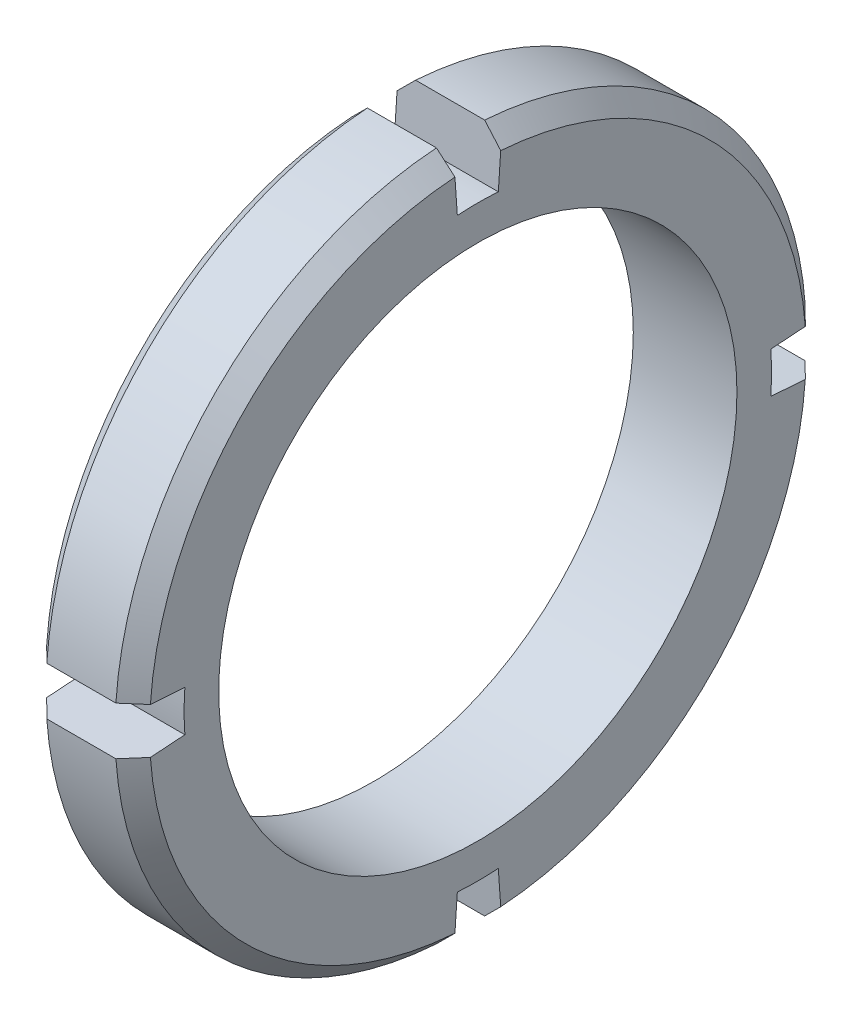
ISO-10303-21;
HEADER;
FILE_DESCRIPTION(('STEP AP214'),'2;1');
FILE_NAME('part.step','',(''),(''),'','','');
FILE_SCHEMA(('AUTOMOTIVE_DESIGN { 1 0 10303 214 1 1 1 1 }'));
ENDSEC;
DATA;
#1=APPLICATION_CONTEXT('core data for automotive mechanical design processes');
#2=APPLICATION_PROTOCOL_DEFINITION('international standard','automotive_design',2000,#1);
#3=PRODUCT_CONTEXT('',#1,'mechanical');
#4=PRODUCT('Part','Part','',(#3));
#5=PRODUCT_RELATED_PRODUCT_CATEGORY('part','',(#4));
#6=PRODUCT_DEFINITION_FORMATION('','',#4);
#7=PRODUCT_DEFINITION_CONTEXT('part definition',#1,'design');
#8=PRODUCT_DEFINITION('design','',#6,#7);
#9=PRODUCT_DEFINITION_SHAPE('','',#8);
#10=(LENGTH_UNIT() NAMED_UNIT(*) SI_UNIT(.MILLI.,.METRE.));
#11=(NAMED_UNIT(*) PLANE_ANGLE_UNIT() SI_UNIT($,.RADIAN.));
#12=(NAMED_UNIT(*) SI_UNIT($,.STERADIAN.) SOLID_ANGLE_UNIT());
#13=UNCERTAINTY_MEASURE_WITH_UNIT(LENGTH_MEASURE(1.E-05),#10,'distance_accuracy_value','');
#14=(GEOMETRIC_REPRESENTATION_CONTEXT(3) GLOBAL_UNCERTAINTY_ASSIGNED_CONTEXT((#13)) GLOBAL_UNIT_ASSIGNED_CONTEXT((#10,
#11,#12)) REPRESENTATION_CONTEXT('',''));
#15=CARTESIAN_POINT('',(0.,0.,0.));
#16=DIRECTION('',(0.,0.,1.));
#17=DIRECTION('',(1.,0.,0.));
#18=AXIS2_PLACEMENT_3D('',#15,#16,#17);
#19=CARTESIAN_POINT('',(6.,0.,0.));
#20=DIRECTION('',(-1.,0.,0.));
#21=DIRECTION('',(0.,0.,1.));
#22=AXIS2_PLACEMENT_3D('',#19,#20,#21);
#23=CYLINDRICAL_SURFACE('',#22,20.);
#24=CARTESIAN_POINT('',(4.99999999999999,0.,0.));
#25=DIRECTION('',(1.,0.,0.));
#26=DIRECTION('',(0.,0.,-1.));
#27=AXIS2_PLACEMENT_3D('',#24,#25,#26);
#28=CIRCLE('',#27,20.);
#29=CARTESIAN_POINT('',(4.99999999999999,-1.39512947488251,-19.9512810051965));
#30=VERTEX_POINT('',#29);
#31=CARTESIAN_POINT('',(4.99999999999999,-19.9512810051965,-1.39512947488272));
#32=VERTEX_POINT('',#31);
#33=EDGE_CURVE('E324',#30,#32,#28,.F.);
#34=ORIENTED_EDGE('',*,*,#33,.T.);
#35=DIRECTION('',(-1.,0.,0.));
#36=VECTOR('',#35,1.);
#37=CARTESIAN_POINT('',(6.,-19.9512810051965,-1.39512947488272));
#38=LINE('',#37,#36);
#39=CARTESIAN_POINT('',(1.,-19.9512810051965,-1.39512947488272));
#40=VERTEX_POINT('',#39);
#41=EDGE_CURVE('E230',#32,#40,#38,.T.);
#42=ORIENTED_EDGE('',*,*,#41,.T.);
#43=CARTESIAN_POINT('',(1.,0.,0.));
#44=DIRECTION('',(1.,0.,0.));
#45=DIRECTION('',(0.,0.,-1.));
#46=AXIS2_PLACEMENT_3D('',#43,#44,#45);
#47=CIRCLE('',#46,20.);
#48=CARTESIAN_POINT('',(1.,-1.39512947488251,-19.9512810051965));
#49=VERTEX_POINT('',#48);
#50=EDGE_CURVE('E327',#40,#49,#47,.T.);
#51=ORIENTED_EDGE('',*,*,#50,.T.);
#52=DIRECTION('',(-1.,0.,0.));
#53=VECTOR('',#52,1.);
#54=CARTESIAN_POINT('',(6.,-1.39512947488251,-19.9512810051965));
#55=LINE('',#54,#53);
#56=EDGE_CURVE('E300',#49,#30,#55,.F.);
#57=ORIENTED_EDGE('',*,*,#56,.T.);
#58=EDGE_LOOP('',(#34,#42,#51,#57));
#59=FACE_BOUND('',#58,.T.);
#60=ADVANCED_FACE('F33',(#59),#23,.T.);
#61=CARTESIAN_POINT('',(1.,0.,0.));
#62=DIRECTION('',(1.,0.,0.));
#63=DIRECTION('',(0.,0.,-1.));
#64=AXIS2_PLACEMENT_3D('',#61,#62,#63);
#65=CONICAL_SURFACE('',#64,20.,0.78539816339745);
#66=DIRECTION('',(-0.707106781186546,0.70538430460664,0.04932527561614));
#67=VECTOR('',#66,1.);
#68=CARTESIAN_POINT('',(-18.9999999999999,0.,0.));
#69=LINE('',#68,#67);
#70=CARTESIAN_POINT('',(0.,-18.9537169549366,-1.32537300113858));
#71=VERTEX_POINT('',#70);
#72=EDGE_CURVE('E228',#71,#40,#69,.F.);
#73=ORIENTED_EDGE('',*,*,#72,.F.);
#74=CARTESIAN_POINT('',(0.,0.,0.));
#75=DIRECTION('',(1.,0.,0.));
#76=DIRECTION('',(0.,0.,-1.));
#77=AXIS2_PLACEMENT_3D('',#74,#75,#76);
#78=CIRCLE('',#77,19.);
#79=CARTESIAN_POINT('',(0.,-1.32537300113838,-18.9537169549367));
#80=VERTEX_POINT('',#79);
#81=EDGE_CURVE('E334',#80,#71,#78,.F.);
#82=ORIENTED_EDGE('',*,*,#81,.F.);
#83=DIRECTION('',(0.707106781186546,-0.0493252756161326,-0.705384304606641));
#84=VECTOR('',#83,1.);
#85=CARTESIAN_POINT('',(-18.9999999999999,0.,0.));
#86=LINE('',#85,#84);
#87=EDGE_CURVE('E304',#49,#80,#86,.F.);
#88=ORIENTED_EDGE('',*,*,#87,.F.);
#89=ORIENTED_EDGE('',*,*,#50,.F.);
#90=EDGE_LOOP('',(#73,#82,#88,#89));
#91=FACE_BOUND('',#90,.T.);
#92=ADVANCED_FACE('F411',(#91),#65,.T.);
#93=CARTESIAN_POINT('',(6.,0.,0.));
#94=DIRECTION('',(-1.,0.,0.));
#95=DIRECTION('',(0.,0.,1.));
#96=AXIS2_PLACEMENT_3D('',#93,#94,#95);
#97=CONICAL_SURFACE('',#96,19.,0.785398163397443);
#98=DIRECTION('',(-0.707106781186551,-0.705384304606635,-0.0493252756161397));
#99=VECTOR('',#98,1.);
#100=CARTESIAN_POINT('',(25.0000000000002,0.,0.));
#101=LINE('',#100,#99);
#102=CARTESIAN_POINT('',(6.,-18.9537169549366,-1.32537300113859));
#103=VERTEX_POINT('',#102);
#104=EDGE_CURVE('E233',#32,#103,#101,.F.);
#105=ORIENTED_EDGE('',*,*,#104,.F.);
#106=ORIENTED_EDGE('',*,*,#33,.F.);
#107=DIRECTION('',(0.707106781186551,0.0493252756161322,0.705384304606636));
#108=VECTOR('',#107,1.);
#109=CARTESIAN_POINT('',(25.0000000000002,0.,0.));
#110=LINE('',#109,#108);
#111=CARTESIAN_POINT('',(6.,-1.32537300113838,-18.9537169549367));
#112=VERTEX_POINT('',#111);
#113=EDGE_CURVE('E342',#112,#30,#110,.F.);
#114=ORIENTED_EDGE('',*,*,#113,.F.);
#115=CARTESIAN_POINT('',(6.,0.,0.));
#116=DIRECTION('',(1.,0.,0.));
#117=DIRECTION('',(0.,0.,-1.));
#118=AXIS2_PLACEMENT_3D('',#115,#116,#117);
#119=CIRCLE('',#118,19.);
#120=EDGE_CURVE('E337',#103,#112,#119,.T.);
#121=ORIENTED_EDGE('',*,*,#120,.F.);
#122=EDGE_LOOP('',(#105,#106,#114,#121));
#123=FACE_BOUND('',#122,.T.);
#124=ADVANCED_FACE('F377',(#123),#97,.T.);
#125=CARTESIAN_POINT('',(1.,-1.39512947488251,19.9512810051965));
#126=VERTEX_POINT('',#125);
#127=CARTESIAN_POINT('',(1.,-19.9512810051965,1.3951294748823));
#128=VERTEX_POINT('',#127);
#129=EDGE_CURVE('E399',#126,#128,#47,.T.);
#130=ORIENTED_EDGE('',*,*,#129,.T.);
#131=DIRECTION('',(-1.,0.,0.));
#132=VECTOR('',#131,1.);
#133=CARTESIAN_POINT('',(6.,-19.9512810051965,1.3951294748823));
#134=LINE('',#133,#132);
#135=CARTESIAN_POINT('',(4.99999999999999,-19.9512810051965,1.3951294748823));
#136=VERTEX_POINT('',#135);
#137=EDGE_CURVE('E223',#128,#136,#134,.F.);
#138=ORIENTED_EDGE('',*,*,#137,.T.);
#139=CARTESIAN_POINT('',(4.99999999999999,-1.39512947488251,19.9512810051965));
#140=VERTEX_POINT('',#139);
#141=EDGE_CURVE('E328',#136,#140,#28,.F.);
#142=ORIENTED_EDGE('',*,*,#141,.T.);
#143=DIRECTION('',(-1.,0.,0.));
#144=VECTOR('',#143,1.);
#145=CARTESIAN_POINT('',(6.,-1.39512947488251,19.9512810051965));
#146=LINE('',#145,#144);
#147=EDGE_CURVE('E255',#140,#126,#146,.T.);
#148=ORIENTED_EDGE('',*,*,#147,.T.);
#149=EDGE_LOOP('',(#130,#138,#142,#148));
#150=FACE_BOUND('',#149,.T.);
#151=ADVANCED_FACE('F457',(#150),#23,.T.);
#152=DIRECTION('',(0.707106781186546,-0.705384304606642,0.0493252756161252));
#153=VECTOR('',#152,1.);
#154=CARTESIAN_POINT('',(-18.9999999999999,0.,0.));
#155=LINE('',#154,#153);
#156=CARTESIAN_POINT('',(0.,-18.9537169549367,1.32537300113819));
#157=VERTEX_POINT('',#156);
#158=EDGE_CURVE('E48',#128,#157,#155,.F.);
#159=ORIENTED_EDGE('',*,*,#158,.F.);
#160=ORIENTED_EDGE('',*,*,#129,.F.);
#161=DIRECTION('',(-0.707106781186546,0.0493252756161326,-0.705384304606641));
#162=VECTOR('',#161,1.);
#163=CARTESIAN_POINT('',(-18.9999999999999,0.,0.));
#164=LINE('',#163,#162);
#165=CARTESIAN_POINT('',(0.,-1.32537300113839,18.9537169549367));
#166=VERTEX_POINT('',#165);
#167=EDGE_CURVE('E253',#166,#126,#164,.F.);
#168=ORIENTED_EDGE('',*,*,#167,.F.);
#169=EDGE_CURVE('E338',#157,#166,#78,.F.);
#170=ORIENTED_EDGE('',*,*,#169,.F.);
#171=EDGE_LOOP('',(#159,#160,#168,#170));
#172=FACE_BOUND('',#171,.T.);
#173=ADVANCED_FACE('F454',(#172),#65,.T.);
#174=DIRECTION('',(0.707106781186551,0.705384304606637,-0.0493252756161248));
#175=VECTOR('',#174,1.);
#176=CARTESIAN_POINT('',(25.0000000000002,0.,0.));
#177=LINE('',#176,#175);
#178=CARTESIAN_POINT('',(6.,-18.9537169549367,1.32537300113819));
#179=VERTEX_POINT('',#178);
#180=EDGE_CURVE('E226',#179,#136,#177,.F.);
#181=ORIENTED_EDGE('',*,*,#180,.F.);
#182=CARTESIAN_POINT('',(6.,-1.32537300113839,18.9537169549367));
#183=VERTEX_POINT('',#182);
#184=EDGE_CURVE('E217',#183,#179,#119,.T.);
#185=ORIENTED_EDGE('',*,*,#184,.F.);
#186=DIRECTION('',(-0.707106781186551,-0.0493252756161323,0.705384304606636));
#187=VECTOR('',#186,1.);
#188=CARTESIAN_POINT('',(25.0000000000002,0.,0.));
#189=LINE('',#188,#187);
#190=EDGE_CURVE('E258',#140,#183,#189,.F.);
#191=ORIENTED_EDGE('',*,*,#190,.F.);
#192=ORIENTED_EDGE('',*,*,#141,.F.);
#193=EDGE_LOOP('',(#181,#185,#191,#192));
#194=FACE_BOUND('',#193,.T.);
#195=ADVANCED_FACE('F456',(#194),#97,.T.);
#196=CARTESIAN_POINT('',(1.,19.9512810051965,1.39512947488258));
#197=VERTEX_POINT('',#196);
#198=CARTESIAN_POINT('',(1.,1.39512947488251,19.9512810051965));
#199=VERTEX_POINT('',#198);
#200=EDGE_CURVE('E333',#197,#199,#47,.T.);
#201=ORIENTED_EDGE('',*,*,#200,.T.);
#202=DIRECTION('',(-1.,0.,0.));
#203=VECTOR('',#202,1.);
#204=CARTESIAN_POINT('',(6.,1.39512947488251,19.9512810051965));
#205=LINE('',#204,#203);
#206=CARTESIAN_POINT('',(4.99999999999999,1.39512947488251,19.9512810051965));
#207=VERTEX_POINT('',#206);
#208=EDGE_CURVE('E248',#199,#207,#205,.F.);
#209=ORIENTED_EDGE('',*,*,#208,.T.);
#210=CARTESIAN_POINT('',(4.99999999999999,19.9512810051965,1.39512947488258));
#211=VERTEX_POINT('',#210);
#212=EDGE_CURVE('E390',#207,#211,#28,.F.);
#213=ORIENTED_EDGE('',*,*,#212,.T.);
#214=DIRECTION('',(-1.,0.,0.));
#215=VECTOR('',#214,1.);
#216=CARTESIAN_POINT('',(6.,19.9512810051965,1.39512947488258));
#217=LINE('',#216,#215);
#218=EDGE_CURVE('E280',#211,#197,#217,.T.);
#219=ORIENTED_EDGE('',*,*,#218,.T.);
#220=EDGE_LOOP('',(#201,#209,#213,#219));
#221=FACE_BOUND('',#220,.T.);
#222=ADVANCED_FACE('F394',(#221),#23,.T.);
#223=DIRECTION('',(0.707106781186546,0.0493252756161326,0.705384304606641));
#224=VECTOR('',#223,1.);
#225=CARTESIAN_POINT('',(-18.9999999999999,0.,0.));
#226=LINE('',#225,#224);
#227=CARTESIAN_POINT('',(0.,1.32537300113838,18.9537169549367));
#228=VERTEX_POINT('',#227);
#229=EDGE_CURVE('E56',#199,#228,#226,.F.);
#230=ORIENTED_EDGE('',*,*,#229,.F.);
#231=ORIENTED_EDGE('',*,*,#200,.F.);
#232=DIRECTION('',(-0.707106781186546,-0.705384304606641,-0.0493252756161351));
#233=VECTOR('',#232,1.);
#234=CARTESIAN_POINT('',(-18.9999999999999,0.,0.));
#235=LINE('',#234,#233);
#236=CARTESIAN_POINT('',(0.,18.9537169549366,1.32537300113845));
#237=VERTEX_POINT('',#236);
#238=EDGE_CURVE('E283',#237,#197,#235,.F.);
#239=ORIENTED_EDGE('',*,*,#238,.F.);
#240=EDGE_CURVE('E446',#228,#237,#78,.F.);
#241=ORIENTED_EDGE('',*,*,#240,.F.);
#242=EDGE_LOOP('',(#230,#231,#239,#241));
#243=FACE_BOUND('',#242,.T.);
#244=ADVANCED_FACE('F445',(#243),#65,.T.);
#245=DIRECTION('',(0.707106781186551,-0.0493252756161322,-0.705384304606636));
#246=VECTOR('',#245,1.);
#247=CARTESIAN_POINT('',(25.0000000000002,0.,0.));
#248=LINE('',#247,#246);
#249=CARTESIAN_POINT('',(6.,1.32537300113838,18.9537169549367));
#250=VERTEX_POINT('',#249);
#251=EDGE_CURVE('E251',#250,#207,#248,.F.);
#252=ORIENTED_EDGE('',*,*,#251,.F.);
#253=CARTESIAN_POINT('',(6.,18.9537169549367,1.32537300113845));
#254=VERTEX_POINT('',#253);
#255=EDGE_CURVE('E343',#254,#250,#119,.T.);
#256=ORIENTED_EDGE('',*,*,#255,.F.);
#257=DIRECTION('',(-0.707106781186551,0.705384304606636,0.0493252756161348));
#258=VECTOR('',#257,1.);
#259=CARTESIAN_POINT('',(25.0000000000002,0.,0.));
#260=LINE('',#259,#258);
#261=EDGE_CURVE('E352',#211,#254,#260,.F.);
#262=ORIENTED_EDGE('',*,*,#261,.F.);
#263=ORIENTED_EDGE('',*,*,#212,.F.);
#264=EDGE_LOOP('',(#252,#256,#262,#263));
#265=FACE_BOUND('',#264,.T.);
#266=ADVANCED_FACE('F388',(#265),#97,.T.);
#267=CARTESIAN_POINT('',(6.,0.,0.));
#268=DIRECTION('',(-1.,0.,0.));
#269=DIRECTION('',(0.,0.,1.));
#270=AXIS2_PLACEMENT_3D('',#267,#268,#269);
#271=CYLINDRICAL_SURFACE('',#270,15.);
#272=CARTESIAN_POINT('',(6.,0.,0.));
#273=DIRECTION('',(1.,0.,0.));
#274=DIRECTION('',(0.,0.,-1.));
#275=AXIS2_PLACEMENT_3D('',#272,#273,#274);
#276=CIRCLE('',#275,15.);
#277=CARTESIAN_POINT('',(6.,0.,-15.));
#278=VERTEX_POINT('',#277);
#279=EDGE_CURVE('E318',#278,#278,#276,.T.);
#280=ORIENTED_EDGE('',*,*,#279,.T.);
#281=EDGE_LOOP('',(#280));
#282=FACE_BOUND('',#281,.T.);
#283=CARTESIAN_POINT('',(0.,0.,0.));
#284=DIRECTION('',(1.,0.,0.));
#285=DIRECTION('',(0.,0.,-1.));
#286=AXIS2_PLACEMENT_3D('',#283,#284,#285);
#287=CIRCLE('',#286,15.);
#288=CARTESIAN_POINT('',(0.,0.,-15.));
#289=VERTEX_POINT('',#288);
#290=EDGE_CURVE('E317',#289,#289,#287,.T.);
#291=ORIENTED_EDGE('',*,*,#290,.F.);
#292=EDGE_LOOP('',(#291));
#293=FACE_BOUND('',#292,.T.);
#294=ADVANCED_FACE('F472',(#282,#293),#271,.F.);
#295=CARTESIAN_POINT('',(1.,1.39512947488251,-19.9512810051965));
#296=VERTEX_POINT('',#295);
#297=CARTESIAN_POINT('',(1.,19.9512810051965,-1.39512947488244));
#298=VERTEX_POINT('',#297);
#299=EDGE_CURVE('E329',#296,#298,#47,.T.);
#300=ORIENTED_EDGE('',*,*,#299,.T.);
#301=DIRECTION('',(-1.,0.,0.));
#302=VECTOR('',#301,1.);
#303=CARTESIAN_POINT('',(6.,19.9512810051965,-1.39512947488244));
#304=LINE('',#303,#302);
#305=CARTESIAN_POINT('',(4.99999999999999,19.9512810051965,-1.39512947488244));
#306=VERTEX_POINT('',#305);
#307=EDGE_CURVE('E271',#298,#306,#304,.F.);
#308=ORIENTED_EDGE('',*,*,#307,.T.);
#309=CARTESIAN_POINT('',(4.99999999999999,1.39512947488251,-19.9512810051965));
#310=VERTEX_POINT('',#309);
#311=EDGE_CURVE('E321',#306,#310,#28,.F.);
#312=ORIENTED_EDGE('',*,*,#311,.T.);
#313=DIRECTION('',(-1.,0.,0.));
#314=VECTOR('',#313,1.);
#315=CARTESIAN_POINT('',(6.,1.39512947488251,-19.9512810051965));
#316=LINE('',#315,#314);
#317=EDGE_CURVE('E309',#310,#296,#316,.T.);
#318=ORIENTED_EDGE('',*,*,#317,.T.);
#319=EDGE_LOOP('',(#300,#308,#312,#318));
#320=FACE_BOUND('',#319,.T.);
#321=ADVANCED_FACE('F429',(#320),#23,.T.);
#322=CARTESIAN_POINT('',(6.,0.,-44.1414213562373));
#323=DIRECTION('',(1.,0.,0.));
#324=DIRECTION('',(0.,0.,-1.));
#325=AXIS2_PLACEMENT_3D('',#322,#323,#324);
#326=PLANE('',#325);
#327=DIRECTION('',(0.,0.997564050259823,0.069756473744136));
#328=VECTOR('',#327,1.);
#329=CARTESIAN_POINT('',(6.,-16.958588854417,-1.18586005365031));
#330=LINE('',#329,#328);
#331=CARTESIAN_POINT('',(6.,-16.958588854417,-1.18586005365031));
#332=VERTEX_POINT('',#331);
#333=EDGE_CURVE('E202',#103,#332,#330,.T.);
#334=ORIENTED_EDGE('',*,*,#333,.F.);
#335=ORIENTED_EDGE('',*,*,#120,.T.);
#336=DIRECTION('',(0.,-0.0697564737441255,-0.997564050259824));
#337=VECTOR('',#336,1.);
#338=CARTESIAN_POINT('',(6.,-1.18586005365013,-16.958588854417));
#339=LINE('',#338,#337);
#340=CARTESIAN_POINT('',(6.,-1.18586005365013,-16.958588854417));
#341=VERTEX_POINT('',#340);
#342=EDGE_CURVE('E291',#341,#112,#339,.T.);
#343=ORIENTED_EDGE('',*,*,#342,.F.);
#344=CARTESIAN_POINT('',(6.,0.,0.));
#345=DIRECTION('',(-1.,0.,0.));
#346=DIRECTION('',(0.,0.,-1.));
#347=AXIS2_PLACEMENT_3D('',#344,#345,#346);
#348=CIRCLE('',#347,17.);
#349=CARTESIAN_POINT('',(6.,1.18586005365014,-16.958588854417));
#350=VERTEX_POINT('',#349);
#351=EDGE_CURVE('E288',#350,#341,#348,.T.);
#352=ORIENTED_EDGE('',*,*,#351,.F.);
#353=DIRECTION('',(0.,-0.0697564737441256,0.997564050259824));
#354=VECTOR('',#353,1.);
#355=CARTESIAN_POINT('',(6.,1.18586005365014,-16.958588854417));
#356=LINE('',#355,#354);
#357=CARTESIAN_POINT('',(6.,1.32537300113839,-18.9537169549367));
#358=VERTEX_POINT('',#357);
#359=EDGE_CURVE('E294',#358,#350,#356,.T.);
#360=ORIENTED_EDGE('',*,*,#359,.F.);
#361=CARTESIAN_POINT('',(6.,18.9537169549367,-1.32537300113832));
#362=VERTEX_POINT('',#361);
#363=EDGE_CURVE('E339',#358,#362,#119,.T.);
#364=ORIENTED_EDGE('',*,*,#363,.T.);
#365=DIRECTION('',(0.,0.997564050259824,-0.069756473744122));
#366=VECTOR('',#365,1.);
#367=CARTESIAN_POINT('',(6.,16.958588854417,-1.18586005365007));
#368=LINE('',#367,#366);
#369=CARTESIAN_POINT('',(6.,16.958588854417,-1.18586005365007));
#370=VERTEX_POINT('',#369);
#371=EDGE_CURVE('E263',#370,#362,#368,.T.);
#372=ORIENTED_EDGE('',*,*,#371,.F.);
#373=CARTESIAN_POINT('',(6.,0.,0.));
#374=DIRECTION('',(-1.,0.,0.));
#375=DIRECTION('',(0.,1.,0.));
#376=AXIS2_PLACEMENT_3D('',#373,#374,#375);
#377=CIRCLE('',#376,17.);
#378=CARTESIAN_POINT('',(6.,16.958588854417,1.18586005365019));
#379=VERTEX_POINT('',#378);
#380=EDGE_CURVE('E260',#379,#370,#377,.T.);
#381=ORIENTED_EDGE('',*,*,#380,.F.);
#382=DIRECTION('',(0.,-0.997564050259824,-0.069756473744129));
#383=VECTOR('',#382,1.);
#384=CARTESIAN_POINT('',(6.,16.958588854417,1.18586005365019));
#385=LINE('',#384,#383);
#386=EDGE_CURVE('E265',#254,#379,#385,.T.);
#387=ORIENTED_EDGE('',*,*,#386,.F.);
#388=ORIENTED_EDGE('',*,*,#255,.T.);
#389=DIRECTION('',(0.,0.0697564737441255,0.997564050259824));
#390=VECTOR('',#389,1.);
#391=CARTESIAN_POINT('',(6.,1.18586005365013,16.958588854417));
#392=LINE('',#391,#390);
#393=CARTESIAN_POINT('',(6.,1.18586005365013,16.958588854417));
#394=VERTEX_POINT('',#393);
#395=EDGE_CURVE('E238',#394,#250,#392,.T.);
#396=ORIENTED_EDGE('',*,*,#395,.F.);
#397=CARTESIAN_POINT('',(6.,0.,0.));
#398=DIRECTION('',(-1.,0.,0.));
#399=DIRECTION('',(0.,0.,1.));
#400=AXIS2_PLACEMENT_3D('',#397,#398,#399);
#401=CIRCLE('',#400,17.);
#402=CARTESIAN_POINT('',(6.,-1.18586005365014,16.958588854417));
#403=VERTEX_POINT('',#402);
#404=EDGE_CURVE('E235',#403,#394,#401,.T.);
#405=ORIENTED_EDGE('',*,*,#404,.F.);
#406=DIRECTION('',(0.,0.0697564737441256,-0.997564050259824));
#407=VECTOR('',#406,1.);
#408=CARTESIAN_POINT('',(6.,-1.18586005365014,16.958588854417));
#409=LINE('',#408,#407);
#410=EDGE_CURVE('E240',#183,#403,#409,.T.);
#411=ORIENTED_EDGE('',*,*,#410,.F.);
#412=ORIENTED_EDGE('',*,*,#184,.T.);
#413=DIRECTION('',(0.,-0.997564050259825,0.069756473744115));
#414=VECTOR('',#413,1.);
#415=CARTESIAN_POINT('',(6.,-16.958588854417,1.18586005364996));
#416=LINE('',#415,#414);
#417=CARTESIAN_POINT('',(6.,-16.958588854417,1.18586005364996));
#418=VERTEX_POINT('',#417);
#419=EDGE_CURVE('E196',#418,#179,#416,.T.);
#420=ORIENTED_EDGE('',*,*,#419,.F.);
#421=CARTESIAN_POINT('',(6.,0.,0.));
#422=DIRECTION('',(-1.,0.,0.));
#423=DIRECTION('',(0.,-1.,0.));
#424=AXIS2_PLACEMENT_3D('',#421,#422,#423);
#425=CIRCLE('',#424,17.);
#426=EDGE_CURVE('E205',#332,#418,#425,.T.);
#427=ORIENTED_EDGE('',*,*,#426,.F.);
#428=EDGE_LOOP('',(#334,#335,#343,#352,#360,#364,#372,#381,#387,#388,#396,#405,#411,#412,#420,#427));
#429=FACE_BOUND('',#428,.T.);
#430=ORIENTED_EDGE('',*,*,#279,.F.);
#431=EDGE_LOOP('',(#430));
#432=FACE_BOUND('',#431,.T.);
#433=ADVANCED_FACE('F213',(#429,#432),#326,.T.);
#434=CARTESIAN_POINT('',(0.,0.,-44.1414213562373));
#435=DIRECTION('',(1.,0.,0.));
#436=DIRECTION('',(0.,0.,-1.));
#437=AXIS2_PLACEMENT_3D('',#434,#435,#436);
#438=PLANE('',#437);
#439=ORIENTED_EDGE('',*,*,#81,.T.);
#440=DIRECTION('',(0.,0.997564050259824,0.069756473744136));
#441=VECTOR('',#440,1.);
#442=CARTESIAN_POINT('',(0.,-3.07164924546667,-0.214790639144202));
#443=LINE('',#442,#441);
#444=CARTESIAN_POINT('',(0.,-16.958588854417,-1.18586005365031));
#445=VERTEX_POINT('',#444);
#446=EDGE_CURVE('E11',#71,#445,#443,.T.);
#447=ORIENTED_EDGE('',*,*,#446,.T.);
#448=CARTESIAN_POINT('',(0.,0.,0.));
#449=DIRECTION('',(1.,0.,0.));
#450=DIRECTION('',(0.,0.,-1.));
#451=AXIS2_PLACEMENT_3D('',#448,#449,#450);
#452=CIRCLE('',#451,17.);
#453=CARTESIAN_POINT('',(0.,-16.958588854417,1.18586005364996));
#454=VERTEX_POINT('',#453);
#455=EDGE_CURVE('E41',#445,#454,#452,.F.);
#456=ORIENTED_EDGE('',*,*,#455,.T.);
#457=DIRECTION('',(0.,-0.997564050259825,0.069756473744115));
#458=VECTOR('',#457,1.);
#459=CARTESIAN_POINT('',(0.,3.07164924546575,-0.21479063914407));
#460=LINE('',#459,#458);
#461=EDGE_CURVE('E198',#454,#157,#460,.T.);
#462=ORIENTED_EDGE('',*,*,#461,.T.);
#463=ORIENTED_EDGE('',*,*,#169,.T.);
#464=DIRECTION('',(0.,0.0697564737441256,-0.997564050259824));
#465=VECTOR('',#464,1.);
#466=CARTESIAN_POINT('',(0.,3.07164924546621,-43.9266307170932));
#467=LINE('',#466,#465);
#468=CARTESIAN_POINT('',(0.,-1.18586005365014,16.958588854417));
#469=VERTEX_POINT('',#468);
#470=EDGE_CURVE('E362',#166,#469,#467,.T.);
#471=ORIENTED_EDGE('',*,*,#470,.T.);
#472=CARTESIAN_POINT('',(0.,0.,0.));
#473=DIRECTION('',(1.,0.,0.));
#474=DIRECTION('',(0.,0.,-1.));
#475=AXIS2_PLACEMENT_3D('',#472,#473,#474);
#476=CIRCLE('',#475,17.);
#477=CARTESIAN_POINT('',(0.,1.18586005365013,16.958588854417));
#478=VERTEX_POINT('',#477);
#479=EDGE_CURVE('E359',#469,#478,#476,.F.);
#480=ORIENTED_EDGE('',*,*,#479,.T.);
#481=DIRECTION('',(0.,0.0697564737441255,0.997564050259824));
#482=VECTOR('',#481,1.);
#483=CARTESIAN_POINT('',(0.,-3.07164924546621,-43.9266307170932));
#484=LINE('',#483,#482);
#485=EDGE_CURVE('E357',#478,#228,#484,.T.);
#486=ORIENTED_EDGE('',*,*,#485,.T.);
#487=ORIENTED_EDGE('',*,*,#240,.T.);
#488=DIRECTION('',(0.,-0.997564050259824,-0.0697564737441291));
#489=VECTOR('',#488,1.);
#490=CARTESIAN_POINT('',(0.,-3.07164924546636,-0.214790639144161));
#491=LINE('',#490,#489);
#492=CARTESIAN_POINT('',(0.,16.958588854417,1.18586005365019));
#493=VERTEX_POINT('',#492);
#494=EDGE_CURVE('E285',#237,#493,#491,.T.);
#495=ORIENTED_EDGE('',*,*,#494,.T.);
#496=CARTESIAN_POINT('',(0.,0.,0.));
#497=DIRECTION('',(1.,0.,0.));
#498=DIRECTION('',(0.,0.,-1.));
#499=AXIS2_PLACEMENT_3D('',#496,#497,#498);
#500=CIRCLE('',#499,17.);
#501=CARTESIAN_POINT('',(0.,16.958588854417,-1.18586005365007));
#502=VERTEX_POINT('',#501);
#503=EDGE_CURVE('E354',#493,#502,#500,.F.);
#504=ORIENTED_EDGE('',*,*,#503,.T.);
#505=DIRECTION('',(0.,0.997564050259825,-0.069756473744122));
#506=VECTOR('',#505,1.);
#507=CARTESIAN_POINT('',(0.,3.07164924546606,-0.214790639144126));
#508=LINE('',#507,#506);
#509=CARTESIAN_POINT('',(0.,18.9537169549367,-1.32537300113832));
#510=VERTEX_POINT('',#509);
#511=EDGE_CURVE('E277',#502,#510,#508,.T.);
#512=ORIENTED_EDGE('',*,*,#511,.T.);
#513=CARTESIAN_POINT('',(0.,1.32537300113839,-18.9537169549367));
#514=VERTEX_POINT('',#513);
#515=EDGE_CURVE('E332',#510,#514,#78,.F.);
#516=ORIENTED_EDGE('',*,*,#515,.T.);
#517=DIRECTION('',(0.,-0.0697564737441256,0.997564050259824));
#518=VECTOR('',#517,1.);
#519=CARTESIAN_POINT('',(0.,3.07164924546621,-43.9266307170932));
#520=LINE('',#519,#518);
#521=CARTESIAN_POINT('',(0.,1.18586005365014,-16.958588854417));
#522=VERTEX_POINT('',#521);
#523=EDGE_CURVE('E314',#514,#522,#520,.T.);
#524=ORIENTED_EDGE('',*,*,#523,.T.);
#525=CARTESIAN_POINT('',(0.,0.,0.));
#526=DIRECTION('',(1.,0.,0.));
#527=DIRECTION('',(0.,0.,-1.));
#528=AXIS2_PLACEMENT_3D('',#525,#526,#527);
#529=CIRCLE('',#528,17.);
#530=CARTESIAN_POINT('',(0.,-1.18586005365013,-16.958588854417));
#531=VERTEX_POINT('',#530);
#532=EDGE_CURVE('E347',#522,#531,#529,.F.);
#533=ORIENTED_EDGE('',*,*,#532,.T.);
#534=DIRECTION('',(0.,-0.0697564737441255,-0.997564050259824));
#535=VECTOR('',#534,1.);
#536=CARTESIAN_POINT('',(0.,-3.07164924546621,-43.9266307170932));
#537=LINE('',#536,#535);
#538=EDGE_CURVE('E306',#531,#80,#537,.T.);
#539=ORIENTED_EDGE('',*,*,#538,.T.);
#540=EDGE_LOOP('',(#439,#447,#456,#462,#463,#471,#480,#486,#487,#495,#504,#512,#516,#524,#533,#539));
#541=FACE_BOUND('',#540,.T.);
#542=ORIENTED_EDGE('',*,*,#290,.T.);
#543=EDGE_LOOP('',(#542));
#544=FACE_BOUND('',#543,.T.);
#545=ADVANCED_FACE('F366',(#541,#544),#438,.F.);
#546=DIRECTION('',(0.707106781186546,0.705384304606641,-0.0493252756161301));
#547=VECTOR('',#546,1.);
#548=CARTESIAN_POINT('',(-18.9999999999999,0.,0.));
#549=LINE('',#548,#547);
#550=EDGE_CURVE('E275',#298,#510,#549,.F.);
#551=ORIENTED_EDGE('',*,*,#550,.F.);
#552=ORIENTED_EDGE('',*,*,#299,.F.);
#553=DIRECTION('',(-0.707106781186546,-0.0493252756161326,0.705384304606641));
#554=VECTOR('',#553,1.);
#555=CARTESIAN_POINT('',(-18.9999999999999,0.,0.));
#556=LINE('',#555,#554);
#557=EDGE_CURVE('E312',#514,#296,#556,.F.);
#558=ORIENTED_EDGE('',*,*,#557,.F.);
#559=ORIENTED_EDGE('',*,*,#515,.F.);
#560=EDGE_LOOP('',(#551,#552,#558,#559));
#561=FACE_BOUND('',#560,.T.);
#562=ADVANCED_FACE('F434',(#561),#65,.T.);
#563=DIRECTION('',(0.707106781186551,-0.705384304606636,0.0493252756161298));
#564=VECTOR('',#563,1.);
#565=CARTESIAN_POINT('',(25.0000000000002,0.,0.));
#566=LINE('',#565,#564);
#567=EDGE_CURVE('E350',#362,#306,#566,.F.);
#568=ORIENTED_EDGE('',*,*,#567,.F.);
#569=ORIENTED_EDGE('',*,*,#363,.F.);
#570=DIRECTION('',(-0.707106781186551,0.0493252756161323,-0.705384304606636));
#571=VECTOR('',#570,1.);
#572=CARTESIAN_POINT('',(25.0000000000002,0.,0.));
#573=LINE('',#572,#571);
#574=EDGE_CURVE('E345',#310,#358,#573,.F.);
#575=ORIENTED_EDGE('',*,*,#574,.F.);
#576=ORIENTED_EDGE('',*,*,#311,.F.);
#577=EDGE_LOOP('',(#568,#569,#575,#576));
#578=FACE_BOUND('',#577,.T.);
#579=ADVANCED_FACE('F35',(#578),#97,.T.);
#580=CARTESIAN_POINT('',(-4.,0.,0.));
#581=DIRECTION('',(1.,0.,0.));
#582=DIRECTION('',(0.,0.,-1.));
#583=AXIS2_PLACEMENT_3D('',#580,#581,#582);
#584=CYLINDRICAL_SURFACE('',#583,17.);
#585=DIRECTION('',(1.,0.,0.));
#586=VECTOR('',#585,1.);
#587=CARTESIAN_POINT('',(-4.,1.18586005365014,-16.958588854417));
#588=LINE('',#587,#586);
#589=EDGE_CURVE('E298',#522,#350,#588,.T.);
#590=ORIENTED_EDGE('',*,*,#589,.T.);
#591=ORIENTED_EDGE('',*,*,#351,.T.);
#592=DIRECTION('',(1.,0.,0.));
#593=VECTOR('',#592,1.);
#594=CARTESIAN_POINT('',(-4.,-1.18586005365013,-16.958588854417));
#595=LINE('',#594,#593);
#596=EDGE_CURVE('E297',#531,#341,#595,.T.);
#597=ORIENTED_EDGE('',*,*,#596,.F.);
#598=ORIENTED_EDGE('',*,*,#532,.F.);
#599=EDGE_LOOP('',(#590,#591,#597,#598));
#600=FACE_BOUND('',#599,.T.);
#601=ADVANCED_FACE('F414',(#600),#584,.T.);
#602=CARTESIAN_POINT('',(-4.,1.18586005365014,-16.958588854417));
#603=DIRECTION('',(0.,0.997564050259824,0.0697564737441256));
#604=DIRECTION('',(0.,-0.0697564737441256,0.997564050259824));
#605=AXIS2_PLACEMENT_3D('',#602,#603,#604);
#606=PLANE('',#605);
#607=ORIENTED_EDGE('',*,*,#557,.T.);
#608=ORIENTED_EDGE('',*,*,#317,.F.);
#609=ORIENTED_EDGE('',*,*,#574,.T.);
#610=ORIENTED_EDGE('',*,*,#359,.T.);
#611=ORIENTED_EDGE('',*,*,#589,.F.);
#612=ORIENTED_EDGE('',*,*,#523,.F.);
#613=EDGE_LOOP('',(#607,#608,#609,#610,#611,#612));
#614=FACE_BOUND('',#613,.T.);
#615=ADVANCED_FACE('F507',(#614),#606,.F.);
#616=CARTESIAN_POINT('',(-4.,-1.18586005365013,-16.958588854417));
#617=DIRECTION('',(0.,-0.997564050259824,0.0697564737441255));
#618=DIRECTION('',(0.,-0.0697564737441255,-0.997564050259824));
#619=AXIS2_PLACEMENT_3D('',#616,#617,#618);
#620=PLANE('',#619);
#621=ORIENTED_EDGE('',*,*,#596,.T.);
#622=ORIENTED_EDGE('',*,*,#342,.T.);
#623=ORIENTED_EDGE('',*,*,#113,.T.);
#624=ORIENTED_EDGE('',*,*,#56,.F.);
#625=ORIENTED_EDGE('',*,*,#87,.T.);
#626=ORIENTED_EDGE('',*,*,#538,.F.);
#627=EDGE_LOOP('',(#621,#622,#623,#624,#625,#626));
#628=FACE_BOUND('',#627,.T.);
#629=ADVANCED_FACE('F409',(#628),#620,.F.);
#630=CARTESIAN_POINT('',(-4.,0.,0.));
#631=DIRECTION('',(1.,0.,0.));
#632=DIRECTION('',(0.,0.,-1.));
#633=AXIS2_PLACEMENT_3D('',#630,#631,#632);
#634=CYLINDRICAL_SURFACE('',#633,17.);
#635=DIRECTION('',(1.,0.,0.));
#636=VECTOR('',#635,1.);
#637=CARTESIAN_POINT('',(-4.,16.958588854417,1.18586005365019));
#638=LINE('',#637,#636);
#639=EDGE_CURVE('E269',#493,#379,#638,.T.);
#640=ORIENTED_EDGE('',*,*,#639,.T.);
#641=ORIENTED_EDGE('',*,*,#380,.T.);
#642=DIRECTION('',(1.,0.,0.));
#643=VECTOR('',#642,1.);
#644=CARTESIAN_POINT('',(-4.,16.958588854417,-1.18586005365007));
#645=LINE('',#644,#643);
#646=EDGE_CURVE('E268',#502,#370,#645,.T.);
#647=ORIENTED_EDGE('',*,*,#646,.F.);
#648=ORIENTED_EDGE('',*,*,#503,.F.);
#649=EDGE_LOOP('',(#640,#641,#647,#648));
#650=FACE_BOUND('',#649,.T.);
#651=ADVANCED_FACE('F441',(#650),#634,.T.);
#652=CARTESIAN_POINT('',(-4.,16.958588854417,1.18586005365019));
#653=DIRECTION('',(0.,-0.0697564737441291,0.997564050259824));
#654=DIRECTION('',(0.,-0.997564050259824,-0.0697564737441291));
#655=AXIS2_PLACEMENT_3D('',#652,#653,#654);
#656=PLANE('',#655);
#657=ORIENTED_EDGE('',*,*,#238,.T.);
#658=ORIENTED_EDGE('',*,*,#218,.F.);
#659=ORIENTED_EDGE('',*,*,#261,.T.);
#660=ORIENTED_EDGE('',*,*,#386,.T.);
#661=ORIENTED_EDGE('',*,*,#639,.F.);
#662=ORIENTED_EDGE('',*,*,#494,.F.);
#663=EDGE_LOOP('',(#657,#658,#659,#660,#661,#662));
#664=FACE_BOUND('',#663,.T.);
#665=ADVANCED_FACE('F443',(#664),#656,.F.);
#666=CARTESIAN_POINT('',(-4.,16.958588854417,-1.18586005365007));
#667=DIRECTION('',(0.,-0.069756473744122,-0.997564050259825));
#668=DIRECTION('',(0.,0.997564050259825,-0.069756473744122));
#669=AXIS2_PLACEMENT_3D('',#666,#667,#668);
#670=PLANE('',#669);
#671=ORIENTED_EDGE('',*,*,#646,.T.);
#672=ORIENTED_EDGE('',*,*,#371,.T.);
#673=ORIENTED_EDGE('',*,*,#567,.T.);
#674=ORIENTED_EDGE('',*,*,#307,.F.);
#675=ORIENTED_EDGE('',*,*,#550,.T.);
#676=ORIENTED_EDGE('',*,*,#511,.F.);
#677=EDGE_LOOP('',(#671,#672,#673,#674,#675,#676));
#678=FACE_BOUND('',#677,.T.);
#679=ADVANCED_FACE('F426',(#678),#670,.F.);
#680=CARTESIAN_POINT('',(-4.,0.,0.));
#681=DIRECTION('',(1.,0.,0.));
#682=DIRECTION('',(0.,0.,-1.));
#683=AXIS2_PLACEMENT_3D('',#680,#681,#682);
#684=CYLINDRICAL_SURFACE('',#683,17.);
#685=DIRECTION('',(1.,0.,0.));
#686=VECTOR('',#685,1.);
#687=CARTESIAN_POINT('',(-4.,-1.18586005365014,16.958588854417));
#688=LINE('',#687,#686);
#689=EDGE_CURVE('E244',#469,#403,#688,.T.);
#690=ORIENTED_EDGE('',*,*,#689,.T.);
#691=ORIENTED_EDGE('',*,*,#404,.T.);
#692=DIRECTION('',(1.,0.,0.));
#693=VECTOR('',#692,1.);
#694=CARTESIAN_POINT('',(-4.,1.18586005365013,16.958588854417));
#695=LINE('',#694,#693);
#696=EDGE_CURVE('E243',#478,#394,#695,.T.);
#697=ORIENTED_EDGE('',*,*,#696,.F.);
#698=ORIENTED_EDGE('',*,*,#479,.F.);
#699=EDGE_LOOP('',(#690,#691,#697,#698));
#700=FACE_BOUND('',#699,.T.);
#701=ADVANCED_FACE('F616',(#700),#684,.T.);
#702=CARTESIAN_POINT('',(-4.,-1.18586005365014,16.958588854417));
#703=DIRECTION('',(0.,-0.997564050259824,-0.0697564737441256));
#704=DIRECTION('',(0.,0.0697564737441256,-0.997564050259824));
#705=AXIS2_PLACEMENT_3D('',#702,#703,#704);
#706=PLANE('',#705);
#707=ORIENTED_EDGE('',*,*,#190,.T.);
#708=ORIENTED_EDGE('',*,*,#410,.T.);
#709=ORIENTED_EDGE('',*,*,#689,.F.);
#710=ORIENTED_EDGE('',*,*,#470,.F.);
#711=ORIENTED_EDGE('',*,*,#167,.T.);
#712=ORIENTED_EDGE('',*,*,#147,.F.);
#713=EDGE_LOOP('',(#707,#708,#709,#710,#711,#712));
#714=FACE_BOUND('',#713,.T.);
#715=ADVANCED_FACE('F452',(#714),#706,.F.);
#716=CARTESIAN_POINT('',(-4.,1.18586005365013,16.958588854417));
#717=DIRECTION('',(0.,0.997564050259824,-0.0697564737441255));
#718=DIRECTION('',(0.,0.0697564737441255,0.997564050259824));
#719=AXIS2_PLACEMENT_3D('',#716,#717,#718);
#720=PLANE('',#719);
#721=ORIENTED_EDGE('',*,*,#251,.T.);
#722=ORIENTED_EDGE('',*,*,#208,.F.);
#723=ORIENTED_EDGE('',*,*,#229,.T.);
#724=ORIENTED_EDGE('',*,*,#485,.F.);
#725=ORIENTED_EDGE('',*,*,#696,.T.);
#726=ORIENTED_EDGE('',*,*,#395,.T.);
#727=EDGE_LOOP('',(#721,#722,#723,#724,#725,#726));
#728=FACE_BOUND('',#727,.T.);
#729=ADVANCED_FACE('F391',(#728),#720,.F.);
#730=CARTESIAN_POINT('',(-4.,0.,0.));
#731=DIRECTION('',(1.,0.,0.));
#732=DIRECTION('',(0.,0.,-1.));
#733=AXIS2_PLACEMENT_3D('',#730,#731,#732);
#734=CYLINDRICAL_SURFACE('',#733,17.);
#735=DIRECTION('',(1.,0.,0.));
#736=VECTOR('',#735,1.);
#737=CARTESIAN_POINT('',(-4.,-16.958588854417,-1.18586005365031));
#738=LINE('',#737,#736);
#739=EDGE_CURVE('E201',#445,#332,#738,.T.);
#740=ORIENTED_EDGE('',*,*,#739,.T.);
#741=ORIENTED_EDGE('',*,*,#426,.T.);
#742=DIRECTION('',(1.,0.,0.));
#743=VECTOR('',#742,1.);
#744=CARTESIAN_POINT('',(-4.,-16.958588854417,1.18586005364996));
#745=LINE('',#744,#743);
#746=EDGE_CURVE('E192',#454,#418,#745,.T.);
#747=ORIENTED_EDGE('',*,*,#746,.F.);
#748=ORIENTED_EDGE('',*,*,#455,.F.);
#749=EDGE_LOOP('',(#740,#741,#747,#748));
#750=FACE_BOUND('',#749,.T.);
#751=ADVANCED_FACE('F206',(#750),#734,.T.);
#752=CARTESIAN_POINT('',(-4.,-16.958588854417,-1.18586005365031));
#753=DIRECTION('',(0.,0.069756473744136,-0.997564050259824));
#754=DIRECTION('',(0.,0.997564050259824,0.069756473744136));
#755=AXIS2_PLACEMENT_3D('',#752,#753,#754);
#756=PLANE('',#755);
#757=ORIENTED_EDGE('',*,*,#104,.T.);
#758=ORIENTED_EDGE('',*,*,#333,.T.);
#759=ORIENTED_EDGE('',*,*,#739,.F.);
#760=ORIENTED_EDGE('',*,*,#446,.F.);
#761=ORIENTED_EDGE('',*,*,#72,.T.);
#762=ORIENTED_EDGE('',*,*,#41,.F.);
#763=EDGE_LOOP('',(#757,#758,#759,#760,#761,#762));
#764=FACE_BOUND('',#763,.T.);
#765=ADVANCED_FACE('F370',(#764),#756,.F.);
#766=CARTESIAN_POINT('',(-4.,-16.958588854417,1.18586005364996));
#767=DIRECTION('',(0.,0.069756473744115,0.997564050259825));
#768=DIRECTION('',(0.,-0.997564050259825,0.069756473744115));
#769=AXIS2_PLACEMENT_3D('',#766,#767,#768);
#770=PLANE('',#769);
#771=ORIENTED_EDGE('',*,*,#180,.T.);
#772=ORIENTED_EDGE('',*,*,#137,.F.);
#773=ORIENTED_EDGE('',*,*,#158,.T.);
#774=ORIENTED_EDGE('',*,*,#461,.F.);
#775=ORIENTED_EDGE('',*,*,#746,.T.);
#776=ORIENTED_EDGE('',*,*,#419,.T.);
#777=EDGE_LOOP('',(#771,#772,#773,#774,#775,#776));
#778=FACE_BOUND('',#777,.T.);
#779=ADVANCED_FACE('F194',(#778),#770,.F.);
#780=CLOSED_SHELL('',(#60,#92,#124,#151,#173,#195,#222,#244,#266,#294,#321,#433,#545,#562,#579,
#601,#615,#629,#651,#665,#679,#701,#715,#729,#751,#765,#779));
#781=MANIFOLD_SOLID_BREP('B2',#780);
#782=ADVANCED_BREP_SHAPE_REPRESENTATION('',(#18,#781),#14);
#783=SHAPE_DEFINITION_REPRESENTATION(#9,#782);
ENDSEC;
END-ISO-10303-21;
